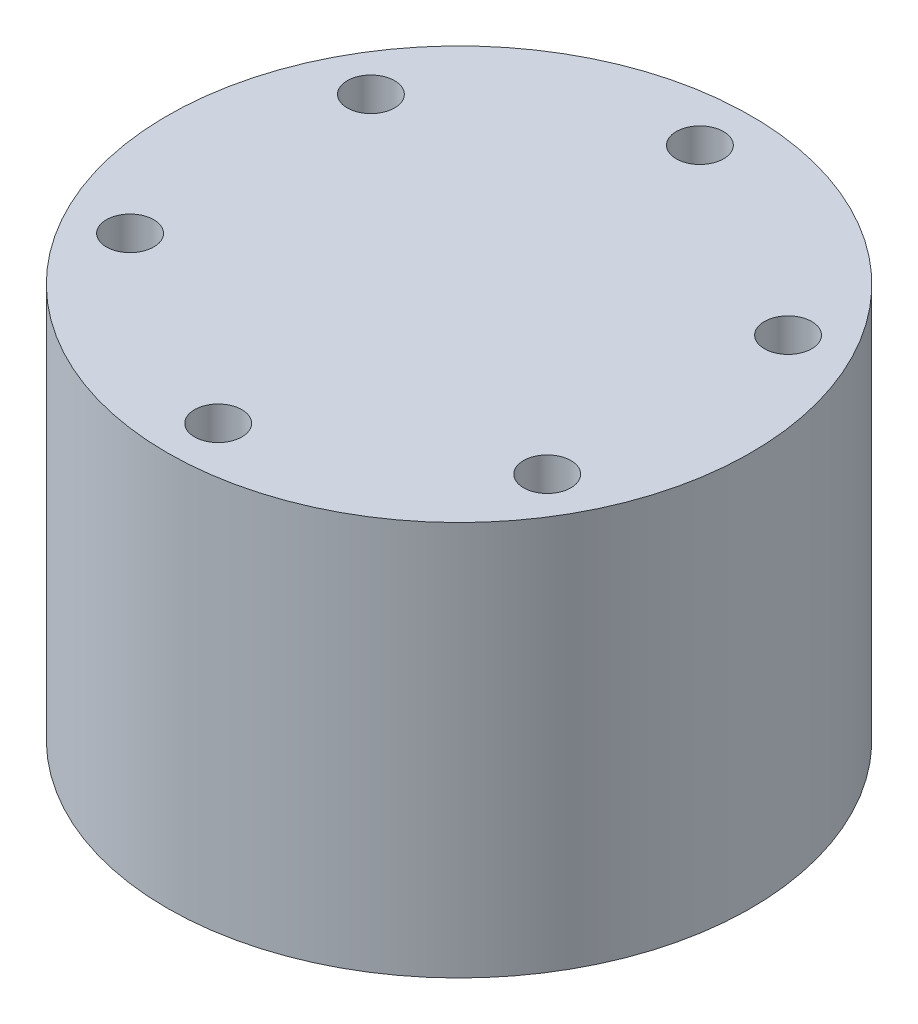
ISO-10303-21;
HEADER;
FILE_DESCRIPTION(('STEP AP214'),'2;1');
FILE_NAME('part.step','',(''),(''),'','','');
FILE_SCHEMA(('AUTOMOTIVE_DESIGN { 1 0 10303 214 1 1 1 1 }'));
ENDSEC;
DATA;
#1=APPLICATION_CONTEXT('core data for automotive mechanical design processes');
#2=APPLICATION_PROTOCOL_DEFINITION('international standard','automotive_design',2000,#1);
#3=PRODUCT_CONTEXT('',#1,'mechanical');
#4=PRODUCT('Part','Part','',(#3));
#5=PRODUCT_RELATED_PRODUCT_CATEGORY('part','',(#4));
#6=PRODUCT_DEFINITION_FORMATION('','',#4);
#7=PRODUCT_DEFINITION_CONTEXT('part definition',#1,'design');
#8=PRODUCT_DEFINITION('design','',#6,#7);
#9=PRODUCT_DEFINITION_SHAPE('','',#8);
#10=(LENGTH_UNIT() NAMED_UNIT(*) SI_UNIT(.MILLI.,.METRE.));
#11=(NAMED_UNIT(*) PLANE_ANGLE_UNIT() SI_UNIT($,.RADIAN.));
#12=(NAMED_UNIT(*) SI_UNIT($,.STERADIAN.) SOLID_ANGLE_UNIT());
#13=UNCERTAINTY_MEASURE_WITH_UNIT(LENGTH_MEASURE(1.E-05),#10,'distance_accuracy_value','');
#14=(GEOMETRIC_REPRESENTATION_CONTEXT(3) GLOBAL_UNCERTAINTY_ASSIGNED_CONTEXT((#13)) GLOBAL_UNIT_ASSIGNED_CONTEXT((#10,
#11,#12)) REPRESENTATION_CONTEXT('',''));
#15=CARTESIAN_POINT('',(0.,0.,0.));
#16=DIRECTION('',(0.,0.,1.));
#17=DIRECTION('',(1.,0.,0.));
#18=AXIS2_PLACEMENT_3D('',#15,#16,#17);
#19=CARTESIAN_POINT('',(0.,25.,0.));
#20=DIRECTION('',(0.,-1.,0.));
#21=DIRECTION('',(0.,0.,-1.));
#22=AXIS2_PLACEMENT_3D('',#19,#20,#21);
#23=CYLINDRICAL_SURFACE('',#22,18.5);
#24=CARTESIAN_POINT('',(0.,25.,0.));
#25=DIRECTION('',(0.,1.,0.));
#26=DIRECTION('',(0.,0.,1.));
#27=AXIS2_PLACEMENT_3D('',#24,#25,#26);
#28=CIRCLE('',#27,18.5);
#29=CARTESIAN_POINT('',(0.,25.,18.5));
#30=VERTEX_POINT('',#29);
#31=EDGE_CURVE('E10',#30,#30,#28,.T.);
#32=ORIENTED_EDGE('',*,*,#31,.F.);
#33=EDGE_LOOP('',(#32));
#34=FACE_BOUND('',#33,.T.);
#35=CARTESIAN_POINT('',(0.,0.,0.));
#36=DIRECTION('',(0.,1.,0.));
#37=DIRECTION('',(0.,0.,1.));
#38=AXIS2_PLACEMENT_3D('',#35,#36,#37);
#39=CIRCLE('',#38,18.5);
#40=CARTESIAN_POINT('',(0.,0.,18.5));
#41=VERTEX_POINT('',#40);
#42=EDGE_CURVE('E50',#41,#41,#39,.T.);
#43=ORIENTED_EDGE('',*,*,#42,.T.);
#44=EDGE_LOOP('',(#43));
#45=FACE_BOUND('',#44,.T.);
#46=ADVANCED_FACE('F47',(#34,#45),#23,.T.);
#47=CARTESIAN_POINT('',(0.,25.,0.));
#48=DIRECTION('',(0.,1.,0.));
#49=DIRECTION('',(0.,0.,1.));
#50=AXIS2_PLACEMENT_3D('',#47,#48,#49);
#51=PLANE('',#50);
#52=CARTESIAN_POINT('',(-13.2198777887695,25.,7.63250000000001));
#53=DIRECTION('',(0.,1.,0.));
#54=DIRECTION('',(0.,0.,1.));
#55=AXIS2_PLACEMENT_3D('',#52,#53,#54);
#56=CIRCLE('',#55,1.5);
#57=CARTESIAN_POINT('',(-13.2198777887695,25.,9.13250000000001));
#58=VERTEX_POINT('',#57);
#59=EDGE_CURVE('E71',#58,#58,#56,.T.);
#60=ORIENTED_EDGE('',*,*,#59,.F.);
#61=EDGE_LOOP('',(#60));
#62=FACE_BOUND('',#61,.T.);
#63=CARTESIAN_POINT('',(0.,25.,15.265));
#64=DIRECTION('',(0.,1.,0.));
#65=DIRECTION('',(0.,0.,1.));
#66=AXIS2_PLACEMENT_3D('',#63,#64,#65);
#67=CIRCLE('',#66,1.5);
#68=CARTESIAN_POINT('',(0.,25.,16.765));
#69=VERTEX_POINT('',#68);
#70=EDGE_CURVE('E79',#69,#69,#67,.T.);
#71=ORIENTED_EDGE('',*,*,#70,.F.);
#72=EDGE_LOOP('',(#71));
#73=FACE_BOUND('',#72,.T.);
#74=CARTESIAN_POINT('',(13.2198777887695,25.,7.6325));
#75=DIRECTION('',(0.,1.,0.));
#76=DIRECTION('',(0.,0.,1.));
#77=AXIS2_PLACEMENT_3D('',#74,#75,#76);
#78=CIRCLE('',#77,1.5);
#79=CARTESIAN_POINT('',(13.2198777887695,25.,9.1325));
#80=VERTEX_POINT('',#79);
#81=EDGE_CURVE('E87',#80,#80,#78,.T.);
#82=ORIENTED_EDGE('',*,*,#81,.F.);
#83=EDGE_LOOP('',(#82));
#84=FACE_BOUND('',#83,.T.);
#85=CARTESIAN_POINT('',(13.2198777887695,25.,-7.6325));
#86=DIRECTION('',(0.,1.,0.));
#87=DIRECTION('',(0.,0.,1.));
#88=AXIS2_PLACEMENT_3D('',#85,#86,#87);
#89=CIRCLE('',#88,1.5);
#90=CARTESIAN_POINT('',(13.2198777887695,25.,-6.1325));
#91=VERTEX_POINT('',#90);
#92=EDGE_CURVE('E95',#91,#91,#89,.T.);
#93=ORIENTED_EDGE('',*,*,#92,.F.);
#94=EDGE_LOOP('',(#93));
#95=FACE_BOUND('',#94,.T.);
#96=CARTESIAN_POINT('',(0.,25.,-15.265));
#97=DIRECTION('',(0.,1.,0.));
#98=DIRECTION('',(0.,0.,1.));
#99=AXIS2_PLACEMENT_3D('',#96,#97,#98);
#100=CIRCLE('',#99,1.5);
#101=CARTESIAN_POINT('',(0.,25.,-13.765));
#102=VERTEX_POINT('',#101);
#103=EDGE_CURVE('E102',#102,#102,#100,.T.);
#104=ORIENTED_EDGE('',*,*,#103,.F.);
#105=EDGE_LOOP('',(#104));
#106=FACE_BOUND('',#105,.T.);
#107=CARTESIAN_POINT('',(-13.2198777887695,25.,-7.6325));
#108=DIRECTION('',(0.,1.,0.));
#109=DIRECTION('',(0.,0.,1.));
#110=AXIS2_PLACEMENT_3D('',#107,#108,#109);
#111=CIRCLE('',#110,1.5);
#112=CARTESIAN_POINT('',(-13.2198777887695,25.,-6.1325));
#113=VERTEX_POINT('',#112);
#114=EDGE_CURVE('E63',#113,#113,#111,.T.);
#115=ORIENTED_EDGE('',*,*,#114,.F.);
#116=EDGE_LOOP('',(#115));
#117=FACE_BOUND('',#116,.T.);
#118=ORIENTED_EDGE('',*,*,#31,.T.);
#119=EDGE_LOOP('',(#118));
#120=FACE_BOUND('',#119,.T.);
#121=ADVANCED_FACE('F118',(#62,#73,#84,#95,#106,#117,#120),#51,.T.);
#122=CARTESIAN_POINT('',(0.,0.,0.));
#123=DIRECTION('',(0.,1.,0.));
#124=DIRECTION('',(0.,0.,1.));
#125=AXIS2_PLACEMENT_3D('',#122,#123,#124);
#126=PLANE('',#125);
#127=ORIENTED_EDGE('',*,*,#42,.F.);
#128=EDGE_LOOP('',(#127));
#129=FACE_BOUND('',#128,.T.);
#130=ADVANCED_FACE('F121',(#129),#126,.F.);
#131=CARTESIAN_POINT('',(-13.2198777887695,15.,-7.6325));
#132=DIRECTION('',(0.,1.,0.));
#133=DIRECTION('',(0.,0.,1.));
#134=AXIS2_PLACEMENT_3D('',#131,#132,#133);
#135=CYLINDRICAL_SURFACE('',#134,1.5);
#136=CARTESIAN_POINT('',(-13.2198777887695,15.,-7.6325));
#137=DIRECTION('',(0.,1.,0.));
#138=DIRECTION('',(0.,0.,1.));
#139=AXIS2_PLACEMENT_3D('',#136,#137,#138);
#140=CIRCLE('',#139,1.5);
#141=CARTESIAN_POINT('',(-13.2198777887695,15.,-6.1325));
#142=VERTEX_POINT('',#141);
#143=EDGE_CURVE('E61',#142,#142,#140,.T.);
#144=ORIENTED_EDGE('',*,*,#143,.F.);
#145=EDGE_LOOP('',(#144));
#146=FACE_BOUND('',#145,.T.);
#147=ORIENTED_EDGE('',*,*,#114,.T.);
#148=EDGE_LOOP('',(#147));
#149=FACE_BOUND('',#148,.T.);
#150=ADVANCED_FACE('F126',(#146,#149),#135,.F.);
#151=CARTESIAN_POINT('',(0.,15.,0.));
#152=DIRECTION('',(0.,1.,0.));
#153=DIRECTION('',(0.,0.,1.));
#154=AXIS2_PLACEMENT_3D('',#151,#152,#153);
#155=PLANE('',#154);
#156=ORIENTED_EDGE('',*,*,#143,.T.);
#157=EDGE_LOOP('',(#156));
#158=FACE_BOUND('',#157,.T.);
#159=ADVANCED_FACE('F114',(#158),#155,.T.);
#160=CARTESIAN_POINT('',(0.,15.,-15.265));
#161=DIRECTION('',(0.,1.,0.));
#162=DIRECTION('',(0.,0.,1.));
#163=AXIS2_PLACEMENT_3D('',#160,#161,#162);
#164=CYLINDRICAL_SURFACE('',#163,1.5);
#165=CARTESIAN_POINT('',(0.,15.,-15.265));
#166=DIRECTION('',(0.,1.,0.));
#167=DIRECTION('',(0.,0.,1.));
#168=AXIS2_PLACEMENT_3D('',#165,#166,#167);
#169=CIRCLE('',#168,1.5);
#170=CARTESIAN_POINT('',(0.,15.,-13.765));
#171=VERTEX_POINT('',#170);
#172=EDGE_CURVE('E67',#171,#171,#169,.T.);
#173=ORIENTED_EDGE('',*,*,#172,.F.);
#174=EDGE_LOOP('',(#173));
#175=FACE_BOUND('',#174,.T.);
#176=ORIENTED_EDGE('',*,*,#103,.T.);
#177=EDGE_LOOP('',(#176));
#178=FACE_BOUND('',#177,.T.);
#179=ADVANCED_FACE('F111',(#175,#178),#164,.F.);
#180=CARTESIAN_POINT('',(0.,15.,0.));
#181=DIRECTION('',(0.,1.,0.));
#182=DIRECTION('',(0.,0.,1.));
#183=AXIS2_PLACEMENT_3D('',#180,#181,#182);
#184=PLANE('',#183);
#185=ORIENTED_EDGE('',*,*,#172,.T.);
#186=EDGE_LOOP('',(#185));
#187=FACE_BOUND('',#186,.T.);
#188=ADVANCED_FACE('F109',(#187),#184,.T.);
#189=CARTESIAN_POINT('',(13.2198777887695,15.,-7.6325));
#190=DIRECTION('',(0.,1.,0.));
#191=DIRECTION('',(0.,0.,1.));
#192=AXIS2_PLACEMENT_3D('',#189,#190,#191);
#193=CYLINDRICAL_SURFACE('',#192,1.5);
#194=CARTESIAN_POINT('',(13.2198777887695,15.,-7.6325));
#195=DIRECTION('',(0.,1.,0.));
#196=DIRECTION('',(0.,0.,1.));
#197=AXIS2_PLACEMENT_3D('',#194,#195,#196);
#198=CIRCLE('',#197,1.5);
#199=CARTESIAN_POINT('',(13.2198777887695,15.,-6.1325));
#200=VERTEX_POINT('',#199);
#201=EDGE_CURVE('E99',#200,#200,#198,.T.);
#202=ORIENTED_EDGE('',*,*,#201,.F.);
#203=EDGE_LOOP('',(#202));
#204=FACE_BOUND('',#203,.T.);
#205=ORIENTED_EDGE('',*,*,#92,.T.);
#206=EDGE_LOOP('',(#205));
#207=FACE_BOUND('',#206,.T.);
#208=ADVANCED_FACE('F187',(#204,#207),#193,.F.);
#209=CARTESIAN_POINT('',(0.,15.,0.));
#210=DIRECTION('',(0.,1.,0.));
#211=DIRECTION('',(0.,0.,1.));
#212=AXIS2_PLACEMENT_3D('',#209,#210,#211);
#213=PLANE('',#212);
#214=ORIENTED_EDGE('',*,*,#201,.T.);
#215=EDGE_LOOP('',(#214));
#216=FACE_BOUND('',#215,.T.);
#217=ADVANCED_FACE('F200',(#216),#213,.T.);
#218=CARTESIAN_POINT('',(13.2198777887695,15.,7.6325));
#219=DIRECTION('',(0.,1.,0.));
#220=DIRECTION('',(0.,0.,1.));
#221=AXIS2_PLACEMENT_3D('',#218,#219,#220);
#222=CYLINDRICAL_SURFACE('',#221,1.5);
#223=CARTESIAN_POINT('',(13.2198777887695,15.,7.6325));
#224=DIRECTION('',(0.,1.,0.));
#225=DIRECTION('',(0.,0.,1.));
#226=AXIS2_PLACEMENT_3D('',#223,#224,#225);
#227=CIRCLE('',#226,1.5);
#228=CARTESIAN_POINT('',(13.2198777887695,15.,9.1325));
#229=VERTEX_POINT('',#228);
#230=EDGE_CURVE('E91',#229,#229,#227,.T.);
#231=ORIENTED_EDGE('',*,*,#230,.F.);
#232=EDGE_LOOP('',(#231));
#233=FACE_BOUND('',#232,.T.);
#234=ORIENTED_EDGE('',*,*,#81,.T.);
#235=EDGE_LOOP('',(#234));
#236=FACE_BOUND('',#235,.T.);
#237=ADVANCED_FACE('F211',(#233,#236),#222,.F.);
#238=CARTESIAN_POINT('',(0.,15.,0.));
#239=DIRECTION('',(0.,1.,0.));
#240=DIRECTION('',(0.,0.,1.));
#241=AXIS2_PLACEMENT_3D('',#238,#239,#240);
#242=PLANE('',#241);
#243=ORIENTED_EDGE('',*,*,#230,.T.);
#244=EDGE_LOOP('',(#243));
#245=FACE_BOUND('',#244,.T.);
#246=ADVANCED_FACE('F225',(#245),#242,.T.);
#247=CARTESIAN_POINT('',(0.,15.,15.265));
#248=DIRECTION('',(0.,1.,0.));
#249=DIRECTION('',(0.,0.,1.));
#250=AXIS2_PLACEMENT_3D('',#247,#248,#249);
#251=CYLINDRICAL_SURFACE('',#250,1.5);
#252=CARTESIAN_POINT('',(0.,15.,15.265));
#253=DIRECTION('',(0.,1.,0.));
#254=DIRECTION('',(0.,0.,1.));
#255=AXIS2_PLACEMENT_3D('',#252,#253,#254);
#256=CIRCLE('',#255,1.5);
#257=CARTESIAN_POINT('',(0.,15.,16.765));
#258=VERTEX_POINT('',#257);
#259=EDGE_CURVE('E83',#258,#258,#256,.T.);
#260=ORIENTED_EDGE('',*,*,#259,.F.);
#261=EDGE_LOOP('',(#260));
#262=FACE_BOUND('',#261,.T.);
#263=ORIENTED_EDGE('',*,*,#70,.T.);
#264=EDGE_LOOP('',(#263));
#265=FACE_BOUND('',#264,.T.);
#266=ADVANCED_FACE('F236',(#262,#265),#251,.F.);
#267=CARTESIAN_POINT('',(0.,15.,0.));
#268=DIRECTION('',(0.,1.,0.));
#269=DIRECTION('',(0.,0.,1.));
#270=AXIS2_PLACEMENT_3D('',#267,#268,#269);
#271=PLANE('',#270);
#272=ORIENTED_EDGE('',*,*,#259,.T.);
#273=EDGE_LOOP('',(#272));
#274=FACE_BOUND('',#273,.T.);
#275=ADVANCED_FACE('F250',(#274),#271,.T.);
#276=CARTESIAN_POINT('',(-13.2198777887695,15.,7.63250000000001));
#277=DIRECTION('',(0.,1.,0.));
#278=DIRECTION('',(0.,0.,1.));
#279=AXIS2_PLACEMENT_3D('',#276,#277,#278);
#280=CYLINDRICAL_SURFACE('',#279,1.5);
#281=CARTESIAN_POINT('',(-13.2198777887695,15.,7.63250000000001));
#282=DIRECTION('',(0.,1.,0.));
#283=DIRECTION('',(0.,0.,1.));
#284=AXIS2_PLACEMENT_3D('',#281,#282,#283);
#285=CIRCLE('',#284,1.5);
#286=CARTESIAN_POINT('',(-13.2198777887695,15.,9.13250000000001));
#287=VERTEX_POINT('',#286);
#288=EDGE_CURVE('E75',#287,#287,#285,.T.);
#289=ORIENTED_EDGE('',*,*,#288,.F.);
#290=EDGE_LOOP('',(#289));
#291=FACE_BOUND('',#290,.T.);
#292=ORIENTED_EDGE('',*,*,#59,.T.);
#293=EDGE_LOOP('',(#292));
#294=FACE_BOUND('',#293,.T.);
#295=ADVANCED_FACE('F261',(#291,#294),#280,.F.);
#296=CARTESIAN_POINT('',(0.,15.,0.));
#297=DIRECTION('',(0.,1.,0.));
#298=DIRECTION('',(0.,0.,1.));
#299=AXIS2_PLACEMENT_3D('',#296,#297,#298);
#300=PLANE('',#299);
#301=ORIENTED_EDGE('',*,*,#288,.T.);
#302=EDGE_LOOP('',(#301));
#303=FACE_BOUND('',#302,.T.);
#304=ADVANCED_FACE('F275',(#303),#300,.T.);
#305=CLOSED_SHELL('',(#46,#121,#130,#150,#159,#179,#188,#208,#217,#237,#246,#266,#275,#295,#304));
#306=MANIFOLD_SOLID_BREP('B2',#305);
#307=ADVANCED_BREP_SHAPE_REPRESENTATION('',(#18,#306),#14);
#308=SHAPE_DEFINITION_REPRESENTATION(#9,#307);
ENDSEC;
END-ISO-10303-21;
